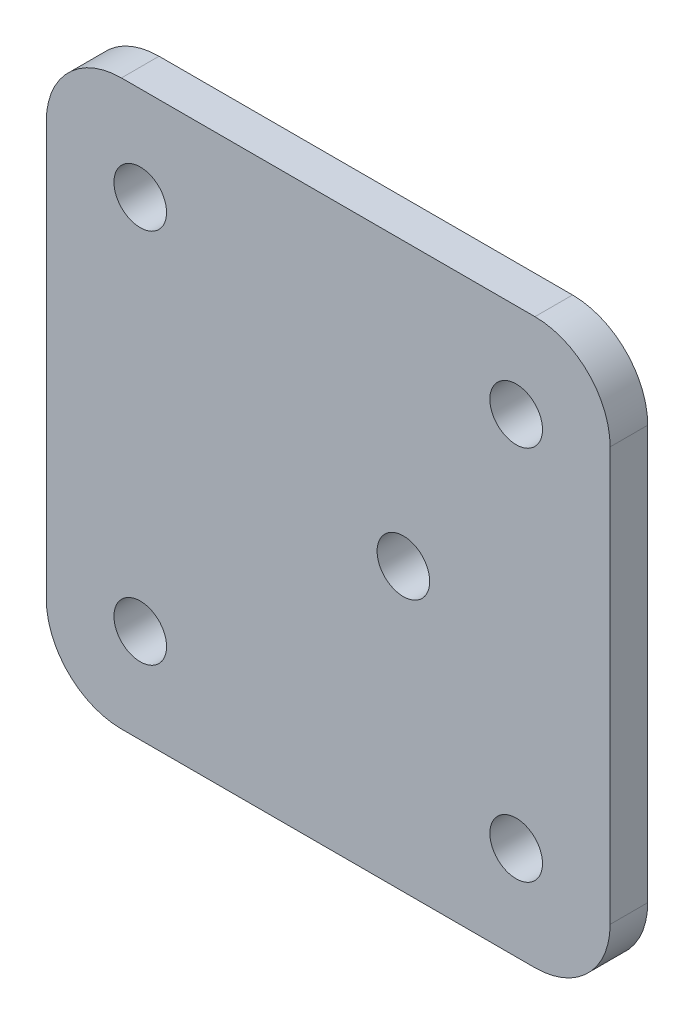
ISO-10303-21;
HEADER;
FILE_DESCRIPTION(('STEP AP214'),'2;1');
FILE_NAME('part.step','',(''),(''),'','','');
FILE_SCHEMA(('AUTOMOTIVE_DESIGN { 1 0 10303 214 1 1 1 1 }'));
ENDSEC;
DATA;
#1=APPLICATION_CONTEXT('core data for automotive mechanical design processes');
#2=APPLICATION_PROTOCOL_DEFINITION('international standard','automotive_design',2000,#1);
#3=PRODUCT_CONTEXT('',#1,'mechanical');
#4=PRODUCT('Part','Part','',(#3));
#5=PRODUCT_RELATED_PRODUCT_CATEGORY('part','',(#4));
#6=PRODUCT_DEFINITION_FORMATION('','',#4);
#7=PRODUCT_DEFINITION_CONTEXT('part definition',#1,'design');
#8=PRODUCT_DEFINITION('design','',#6,#7);
#9=PRODUCT_DEFINITION_SHAPE('','',#8);
#10=(LENGTH_UNIT() NAMED_UNIT(*) SI_UNIT(.MILLI.,.METRE.));
#11=(NAMED_UNIT(*) PLANE_ANGLE_UNIT() SI_UNIT($,.RADIAN.));
#12=(NAMED_UNIT(*) SI_UNIT($,.STERADIAN.) SOLID_ANGLE_UNIT());
#13=UNCERTAINTY_MEASURE_WITH_UNIT(LENGTH_MEASURE(1.E-05),#10,'distance_accuracy_value','');
#14=(GEOMETRIC_REPRESENTATION_CONTEXT(3) GLOBAL_UNCERTAINTY_ASSIGNED_CONTEXT((#13)) GLOBAL_UNIT_ASSIGNED_CONTEXT((#10,
#11,#12)) REPRESENTATION_CONTEXT('',''));
#15=CARTESIAN_POINT('',(0.,0.,0.));
#16=DIRECTION('',(0.,0.,1.));
#17=DIRECTION('',(1.,0.,0.));
#18=AXIS2_PLACEMENT_3D('',#15,#16,#17);
#19=CARTESIAN_POINT('',(-37.5,37.5,5.));
#20=DIRECTION('',(1.,0.,0.));
#21=DIRECTION('',(0.,1.,0.));
#22=AXIS2_PLACEMENT_3D('',#19,#20,#21);
#23=PLANE('',#22);
#24=DIRECTION('',(0.,-1.,0.));
#25=VECTOR('',#24,1.);
#26=CARTESIAN_POINT('',(-37.5,37.5,5.));
#27=LINE('',#26,#25);
#28=CARTESIAN_POINT('',(-37.5,27.5,5.));
#29=VERTEX_POINT('',#28);
#30=CARTESIAN_POINT('',(-37.5,-27.5,5.));
#31=VERTEX_POINT('',#30);
#32=EDGE_CURVE('E124',#29,#31,#27,.T.);
#33=ORIENTED_EDGE('',*,*,#32,.F.);
#34=DIRECTION('',(0.,0.,-1.));
#35=VECTOR('',#34,1.);
#36=CARTESIAN_POINT('',(-37.5,27.5,5.));
#37=LINE('',#36,#35);
#38=CARTESIAN_POINT('',(-37.5,27.5,0.));
#39=VERTEX_POINT('',#38);
#40=EDGE_CURVE('E109',#29,#39,#37,.T.);
#41=ORIENTED_EDGE('',*,*,#40,.T.);
#42=DIRECTION('',(0.,-1.,0.));
#43=VECTOR('',#42,1.);
#44=CARTESIAN_POINT('',(-37.5,37.5,0.));
#45=LINE('',#44,#43);
#46=CARTESIAN_POINT('',(-37.5,-27.5,0.));
#47=VERTEX_POINT('',#46);
#48=EDGE_CURVE('E121',#39,#47,#45,.T.);
#49=ORIENTED_EDGE('',*,*,#48,.T.);
#50=DIRECTION('',(0.,0.,-1.));
#51=VECTOR('',#50,1.);
#52=CARTESIAN_POINT('',(-37.5,-27.5,5.));
#53=LINE('',#52,#51);
#54=EDGE_CURVE('E126',#47,#31,#53,.F.);
#55=ORIENTED_EDGE('',*,*,#54,.T.);
#56=EDGE_LOOP('',(#33,#41,#49,#55));
#57=FACE_BOUND('',#56,.T.);
#58=ADVANCED_FACE('F39',(#57),#23,.F.);
#59=CARTESIAN_POINT('',(-37.5,-37.5,5.));
#60=DIRECTION('',(0.,1.,0.));
#61=DIRECTION('',(-1.,0.,0.));
#62=AXIS2_PLACEMENT_3D('',#59,#60,#61);
#63=PLANE('',#62);
#64=DIRECTION('',(1.,0.,0.));
#65=VECTOR('',#64,1.);
#66=CARTESIAN_POINT('',(-37.5,-37.5,5.));
#67=LINE('',#66,#65);
#68=CARTESIAN_POINT('',(-27.5,-37.5,5.));
#69=VERTEX_POINT('',#68);
#70=CARTESIAN_POINT('',(27.5,-37.5,5.));
#71=VERTEX_POINT('',#70);
#72=EDGE_CURVE('E170',#69,#71,#67,.T.);
#73=ORIENTED_EDGE('',*,*,#72,.F.);
#74=DIRECTION('',(0.,0.,-1.));
#75=VECTOR('',#74,1.);
#76=CARTESIAN_POINT('',(-27.5,-37.5,5.));
#77=LINE('',#76,#75);
#78=CARTESIAN_POINT('',(-27.5,-37.5,0.));
#79=VERTEX_POINT('',#78);
#80=EDGE_CURVE('E163',#69,#79,#77,.T.);
#81=ORIENTED_EDGE('',*,*,#80,.T.);
#82=DIRECTION('',(1.,0.,0.));
#83=VECTOR('',#82,1.);
#84=CARTESIAN_POINT('',(-37.5,-37.5,0.));
#85=LINE('',#84,#83);
#86=CARTESIAN_POINT('',(27.5,-37.5,0.));
#87=VERTEX_POINT('',#86);
#88=EDGE_CURVE('E130',#79,#87,#85,.T.);
#89=ORIENTED_EDGE('',*,*,#88,.T.);
#90=DIRECTION('',(0.,0.,-1.));
#91=VECTOR('',#90,1.);
#92=CARTESIAN_POINT('',(27.5,-37.5,5.));
#93=LINE('',#92,#91);
#94=EDGE_CURVE('E161',#87,#71,#93,.F.);
#95=ORIENTED_EDGE('',*,*,#94,.T.);
#96=EDGE_LOOP('',(#73,#81,#89,#95));
#97=FACE_BOUND('',#96,.T.);
#98=ADVANCED_FACE('F168',(#97),#63,.F.);
#99=CARTESIAN_POINT('',(37.5,37.5,5.));
#100=DIRECTION('',(-1.,0.,0.));
#101=DIRECTION('',(0.,0.,1.));
#102=AXIS2_PLACEMENT_3D('',#99,#100,#101);
#103=PLANE('',#102);
#104=DIRECTION('',(0.,1.,0.));
#105=VECTOR('',#104,1.);
#106=CARTESIAN_POINT('',(37.5,37.5,5.));
#107=LINE('',#106,#105);
#108=CARTESIAN_POINT('',(37.5,-27.5,5.));
#109=VERTEX_POINT('',#108);
#110=CARTESIAN_POINT('',(37.5,27.5,5.));
#111=VERTEX_POINT('',#110);
#112=EDGE_CURVE('E178',#109,#111,#107,.T.);
#113=ORIENTED_EDGE('',*,*,#112,.F.);
#114=DIRECTION('',(0.,0.,-1.));
#115=VECTOR('',#114,1.);
#116=CARTESIAN_POINT('',(37.5,-27.5,5.));
#117=LINE('',#116,#115);
#118=CARTESIAN_POINT('',(37.5,-27.5,0.));
#119=VERTEX_POINT('',#118);
#120=EDGE_CURVE('E11',#109,#119,#117,.T.);
#121=ORIENTED_EDGE('',*,*,#120,.T.);
#122=DIRECTION('',(0.,1.,0.));
#123=VECTOR('',#122,1.);
#124=CARTESIAN_POINT('',(37.5,37.5,0.));
#125=LINE('',#124,#123);
#126=CARTESIAN_POINT('',(37.5,27.5,0.));
#127=VERTEX_POINT('',#126);
#128=EDGE_CURVE('E134',#119,#127,#125,.T.);
#129=ORIENTED_EDGE('',*,*,#128,.T.);
#130=DIRECTION('',(0.,0.,-1.));
#131=VECTOR('',#130,1.);
#132=CARTESIAN_POINT('',(37.5,27.5,5.));
#133=LINE('',#132,#131);
#134=EDGE_CURVE('E47',#127,#111,#133,.F.);
#135=ORIENTED_EDGE('',*,*,#134,.T.);
#136=EDGE_LOOP('',(#113,#121,#129,#135));
#137=FACE_BOUND('',#136,.T.);
#138=ADVANCED_FACE('F177',(#137),#103,.F.);
#139=CARTESIAN_POINT('',(-37.5,37.5,5.));
#140=DIRECTION('',(0.,-1.,0.));
#141=DIRECTION('',(1.,0.,0.));
#142=AXIS2_PLACEMENT_3D('',#139,#140,#141);
#143=PLANE('',#142);
#144=DIRECTION('',(-1.,0.,0.));
#145=VECTOR('',#144,1.);
#146=CARTESIAN_POINT('',(-37.5,37.5,0.));
#147=LINE('',#146,#145);
#148=CARTESIAN_POINT('',(27.5,37.5,0.));
#149=VERTEX_POINT('',#148);
#150=CARTESIAN_POINT('',(-27.5,37.5,0.));
#151=VERTEX_POINT('',#150);
#152=EDGE_CURVE('E144',#149,#151,#147,.T.);
#153=ORIENTED_EDGE('',*,*,#152,.T.);
#154=DIRECTION('',(0.,0.,-1.));
#155=VECTOR('',#154,1.);
#156=CARTESIAN_POINT('',(-27.5,37.5,5.));
#157=LINE('',#156,#155);
#158=CARTESIAN_POINT('',(-27.5,37.5,5.));
#159=VERTEX_POINT('',#158);
#160=EDGE_CURVE('E110',#151,#159,#157,.F.);
#161=ORIENTED_EDGE('',*,*,#160,.T.);
#162=DIRECTION('',(-1.,0.,0.));
#163=VECTOR('',#162,1.);
#164=CARTESIAN_POINT('',(-37.5,37.5,5.));
#165=LINE('',#164,#163);
#166=CARTESIAN_POINT('',(27.5,37.5,5.));
#167=VERTEX_POINT('',#166);
#168=EDGE_CURVE('E140',#167,#159,#165,.T.);
#169=ORIENTED_EDGE('',*,*,#168,.F.);
#170=DIRECTION('',(0.,0.,-1.));
#171=VECTOR('',#170,1.);
#172=CARTESIAN_POINT('',(27.5,37.5,5.));
#173=LINE('',#172,#171);
#174=EDGE_CURVE('E115',#167,#149,#173,.T.);
#175=ORIENTED_EDGE('',*,*,#174,.T.);
#176=EDGE_LOOP('',(#153,#161,#169,#175));
#177=FACE_BOUND('',#176,.T.);
#178=ADVANCED_FACE('F216',(#177),#143,.F.);
#179=CARTESIAN_POINT('',(0.,0.,5.));
#180=DIRECTION('',(0.,0.,1.));
#181=DIRECTION('',(1.,0.,0.));
#182=AXIS2_PLACEMENT_3D('',#179,#180,#181);
#183=PLANE('',#182);
#184=CARTESIAN_POINT('',(10.,0.,5.));
#185=DIRECTION('',(0.,0.,1.));
#186=DIRECTION('',(1.,0.,0.));
#187=AXIS2_PLACEMENT_3D('',#184,#185,#186);
#188=CIRCLE('',#187,3.5);
#189=CARTESIAN_POINT('',(13.5,0.,5.));
#190=VERTEX_POINT('',#189);
#191=EDGE_CURVE('E207',#190,#190,#188,.T.);
#192=ORIENTED_EDGE('',*,*,#191,.F.);
#193=EDGE_LOOP('',(#192));
#194=FACE_BOUND('',#193,.T.);
#195=CARTESIAN_POINT('',(-25.,25.,5.));
#196=DIRECTION('',(0.,0.,1.));
#197=DIRECTION('',(1.,0.,0.));
#198=AXIS2_PLACEMENT_3D('',#195,#196,#197);
#199=CIRCLE('',#198,3.5);
#200=CARTESIAN_POINT('',(-21.5,25.,5.));
#201=VERTEX_POINT('',#200);
#202=EDGE_CURVE('E201',#201,#201,#199,.T.);
#203=ORIENTED_EDGE('',*,*,#202,.F.);
#204=EDGE_LOOP('',(#203));
#205=FACE_BOUND('',#204,.T.);
#206=CARTESIAN_POINT('',(-25.,-25.,5.));
#207=DIRECTION('',(0.,0.,1.));
#208=DIRECTION('',(1.,0.,0.));
#209=AXIS2_PLACEMENT_3D('',#206,#207,#208);
#210=CIRCLE('',#209,3.5);
#211=CARTESIAN_POINT('',(-21.5,-25.,5.));
#212=VERTEX_POINT('',#211);
#213=EDGE_CURVE('E195',#212,#212,#210,.T.);
#214=ORIENTED_EDGE('',*,*,#213,.F.);
#215=EDGE_LOOP('',(#214));
#216=FACE_BOUND('',#215,.T.);
#217=CARTESIAN_POINT('',(25.,-25.,5.));
#218=DIRECTION('',(0.,0.,1.));
#219=DIRECTION('',(1.,0.,0.));
#220=AXIS2_PLACEMENT_3D('',#217,#218,#219);
#221=CIRCLE('',#220,3.5);
#222=CARTESIAN_POINT('',(28.5,-25.,5.));
#223=VERTEX_POINT('',#222);
#224=EDGE_CURVE('E189',#223,#223,#221,.T.);
#225=ORIENTED_EDGE('',*,*,#224,.F.);
#226=EDGE_LOOP('',(#225));
#227=FACE_BOUND('',#226,.T.);
#228=CARTESIAN_POINT('',(25.,25.,5.));
#229=DIRECTION('',(0.,0.,1.));
#230=DIRECTION('',(1.,0.,0.));
#231=AXIS2_PLACEMENT_3D('',#228,#229,#230);
#232=CIRCLE('',#231,3.5);
#233=CARTESIAN_POINT('',(28.5,25.,5.));
#234=VERTEX_POINT('',#233);
#235=EDGE_CURVE('E137',#234,#234,#232,.T.);
#236=ORIENTED_EDGE('',*,*,#235,.F.);
#237=EDGE_LOOP('',(#236));
#238=FACE_BOUND('',#237,.T.);
#239=ORIENTED_EDGE('',*,*,#168,.T.);
#240=CARTESIAN_POINT('',(-27.5,27.5,5.));
#241=DIRECTION('',(0.,0.,1.));
#242=DIRECTION('',(1.,0.,0.));
#243=AXIS2_PLACEMENT_3D('',#240,#241,#242);
#244=CIRCLE('',#243,10.);
#245=EDGE_CURVE('E159',#159,#29,#244,.T.);
#246=ORIENTED_EDGE('',*,*,#245,.T.);
#247=ORIENTED_EDGE('',*,*,#32,.T.);
#248=CARTESIAN_POINT('',(-27.5,-27.5,5.));
#249=DIRECTION('',(0.,0.,1.));
#250=DIRECTION('',(1.,0.,0.));
#251=AXIS2_PLACEMENT_3D('',#248,#249,#250);
#252=CIRCLE('',#251,10.);
#253=EDGE_CURVE('E157',#31,#69,#252,.T.);
#254=ORIENTED_EDGE('',*,*,#253,.T.);
#255=ORIENTED_EDGE('',*,*,#72,.T.);
#256=CARTESIAN_POINT('',(27.5,-27.5,5.));
#257=DIRECTION('',(0.,0.,1.));
#258=DIRECTION('',(1.,0.,0.));
#259=AXIS2_PLACEMENT_3D('',#256,#257,#258);
#260=CIRCLE('',#259,10.);
#261=EDGE_CURVE('E60',#71,#109,#260,.T.);
#262=ORIENTED_EDGE('',*,*,#261,.T.);
#263=ORIENTED_EDGE('',*,*,#112,.T.);
#264=CARTESIAN_POINT('',(27.5,27.5,5.));
#265=DIRECTION('',(0.,0.,1.));
#266=DIRECTION('',(1.,0.,0.));
#267=AXIS2_PLACEMENT_3D('',#264,#265,#266);
#268=CIRCLE('',#267,10.);
#269=EDGE_CURVE('E154',#111,#167,#268,.T.);
#270=ORIENTED_EDGE('',*,*,#269,.T.);
#271=EDGE_LOOP('',(#239,#246,#247,#254,#255,#262,#263,#270));
#272=FACE_BOUND('',#271,.T.);
#273=ADVANCED_FACE('F213',(#194,#205,#216,#227,#238,#272),#183,.T.);
#274=CARTESIAN_POINT('',(0.,0.,0.));
#275=DIRECTION('',(0.,0.,1.));
#276=DIRECTION('',(1.,0.,0.));
#277=AXIS2_PLACEMENT_3D('',#274,#275,#276);
#278=PLANE('',#277);
#279=CARTESIAN_POINT('',(10.,0.,0.));
#280=DIRECTION('',(0.,0.,1.));
#281=DIRECTION('',(1.,0.,0.));
#282=AXIS2_PLACEMENT_3D('',#279,#280,#281);
#283=CIRCLE('',#282,3.5);
#284=CARTESIAN_POINT('',(13.5,0.,0.));
#285=VERTEX_POINT('',#284);
#286=EDGE_CURVE('E204',#285,#285,#283,.T.);
#287=ORIENTED_EDGE('',*,*,#286,.T.);
#288=EDGE_LOOP('',(#287));
#289=FACE_BOUND('',#288,.T.);
#290=CARTESIAN_POINT('',(-25.,25.,0.));
#291=DIRECTION('',(0.,0.,1.));
#292=DIRECTION('',(1.,0.,0.));
#293=AXIS2_PLACEMENT_3D('',#290,#291,#292);
#294=CIRCLE('',#293,3.5);
#295=CARTESIAN_POINT('',(-21.5,25.,0.));
#296=VERTEX_POINT('',#295);
#297=EDGE_CURVE('E198',#296,#296,#294,.T.);
#298=ORIENTED_EDGE('',*,*,#297,.T.);
#299=EDGE_LOOP('',(#298));
#300=FACE_BOUND('',#299,.T.);
#301=CARTESIAN_POINT('',(-25.,-25.,0.));
#302=DIRECTION('',(0.,0.,1.));
#303=DIRECTION('',(1.,0.,0.));
#304=AXIS2_PLACEMENT_3D('',#301,#302,#303);
#305=CIRCLE('',#304,3.5);
#306=CARTESIAN_POINT('',(-21.5,-25.,0.));
#307=VERTEX_POINT('',#306);
#308=EDGE_CURVE('E192',#307,#307,#305,.T.);
#309=ORIENTED_EDGE('',*,*,#308,.T.);
#310=EDGE_LOOP('',(#309));
#311=FACE_BOUND('',#310,.T.);
#312=CARTESIAN_POINT('',(25.,-25.,0.));
#313=DIRECTION('',(0.,0.,1.));
#314=DIRECTION('',(1.,0.,0.));
#315=AXIS2_PLACEMENT_3D('',#312,#313,#314);
#316=CIRCLE('',#315,3.5);
#317=CARTESIAN_POINT('',(28.5,-25.,0.));
#318=VERTEX_POINT('',#317);
#319=EDGE_CURVE('E186',#318,#318,#316,.T.);
#320=ORIENTED_EDGE('',*,*,#319,.T.);
#321=EDGE_LOOP('',(#320));
#322=FACE_BOUND('',#321,.T.);
#323=CARTESIAN_POINT('',(25.,25.,0.));
#324=DIRECTION('',(0.,0.,1.));
#325=DIRECTION('',(1.,0.,0.));
#326=AXIS2_PLACEMENT_3D('',#323,#324,#325);
#327=CIRCLE('',#326,3.5);
#328=CARTESIAN_POINT('',(28.5,25.,0.));
#329=VERTEX_POINT('',#328);
#330=EDGE_CURVE('E131',#329,#329,#327,.T.);
#331=ORIENTED_EDGE('',*,*,#330,.T.);
#332=EDGE_LOOP('',(#331));
#333=FACE_BOUND('',#332,.T.);
#334=ORIENTED_EDGE('',*,*,#48,.F.);
#335=CARTESIAN_POINT('',(-27.5,27.5,0.));
#336=DIRECTION('',(0.,0.,1.));
#337=DIRECTION('',(1.,0.,0.));
#338=AXIS2_PLACEMENT_3D('',#335,#336,#337);
#339=CIRCLE('',#338,10.);
#340=EDGE_CURVE('E105',#39,#151,#339,.F.);
#341=ORIENTED_EDGE('',*,*,#340,.T.);
#342=ORIENTED_EDGE('',*,*,#152,.F.);
#343=CARTESIAN_POINT('',(27.5,27.5,0.));
#344=DIRECTION('',(0.,0.,1.));
#345=DIRECTION('',(1.,0.,0.));
#346=AXIS2_PLACEMENT_3D('',#343,#344,#345);
#347=CIRCLE('',#346,10.);
#348=EDGE_CURVE('E125',#149,#127,#347,.F.);
#349=ORIENTED_EDGE('',*,*,#348,.T.);
#350=ORIENTED_EDGE('',*,*,#128,.F.);
#351=CARTESIAN_POINT('',(27.5,-27.5,0.));
#352=DIRECTION('',(0.,0.,1.));
#353=DIRECTION('',(1.,0.,0.));
#354=AXIS2_PLACEMENT_3D('',#351,#352,#353);
#355=CIRCLE('',#354,10.);
#356=EDGE_CURVE('E148',#119,#87,#355,.F.);
#357=ORIENTED_EDGE('',*,*,#356,.T.);
#358=ORIENTED_EDGE('',*,*,#88,.F.);
#359=CARTESIAN_POINT('',(-27.5,-27.5,0.));
#360=DIRECTION('',(0.,0.,1.));
#361=DIRECTION('',(1.,0.,0.));
#362=AXIS2_PLACEMENT_3D('',#359,#360,#361);
#363=CIRCLE('',#362,10.);
#364=EDGE_CURVE('E116',#79,#47,#363,.F.);
#365=ORIENTED_EDGE('',*,*,#364,.T.);
#366=EDGE_LOOP('',(#334,#341,#342,#349,#350,#357,#358,#365));
#367=FACE_BOUND('',#366,.T.);
#368=ADVANCED_FACE('F128',(#289,#300,#311,#322,#333,#367),#278,.F.);
#369=CARTESIAN_POINT('',(25.,25.,5.));
#370=DIRECTION('',(0.,0.,1.));
#371=DIRECTION('',(1.,0.,0.));
#372=AXIS2_PLACEMENT_3D('',#369,#370,#371);
#373=CYLINDRICAL_SURFACE('',#372,3.5);
#374=ORIENTED_EDGE('',*,*,#330,.F.);
#375=EDGE_LOOP('',(#374));
#376=FACE_BOUND('',#375,.T.);
#377=ORIENTED_EDGE('',*,*,#235,.T.);
#378=EDGE_LOOP('',(#377));
#379=FACE_BOUND('',#378,.T.);
#380=ADVANCED_FACE('F280',(#376,#379),#373,.F.);
#381=CARTESIAN_POINT('',(25.,-25.,5.));
#382=DIRECTION('',(0.,0.,1.));
#383=DIRECTION('',(1.,0.,0.));
#384=AXIS2_PLACEMENT_3D('',#381,#382,#383);
#385=CYLINDRICAL_SURFACE('',#384,3.5);
#386=ORIENTED_EDGE('',*,*,#319,.F.);
#387=EDGE_LOOP('',(#386));
#388=FACE_BOUND('',#387,.T.);
#389=ORIENTED_EDGE('',*,*,#224,.T.);
#390=EDGE_LOOP('',(#389));
#391=FACE_BOUND('',#390,.T.);
#392=ADVANCED_FACE('F295',(#388,#391),#385,.F.);
#393=CARTESIAN_POINT('',(-25.,-25.,5.));
#394=DIRECTION('',(0.,0.,1.));
#395=DIRECTION('',(1.,0.,0.));
#396=AXIS2_PLACEMENT_3D('',#393,#394,#395);
#397=CYLINDRICAL_SURFACE('',#396,3.5);
#398=ORIENTED_EDGE('',*,*,#308,.F.);
#399=EDGE_LOOP('',(#398));
#400=FACE_BOUND('',#399,.T.);
#401=ORIENTED_EDGE('',*,*,#213,.T.);
#402=EDGE_LOOP('',(#401));
#403=FACE_BOUND('',#402,.T.);
#404=ADVANCED_FACE('F302',(#400,#403),#397,.F.);
#405=CARTESIAN_POINT('',(-25.,25.,5.));
#406=DIRECTION('',(0.,0.,1.));
#407=DIRECTION('',(1.,0.,0.));
#408=AXIS2_PLACEMENT_3D('',#405,#406,#407);
#409=CYLINDRICAL_SURFACE('',#408,3.5);
#410=ORIENTED_EDGE('',*,*,#297,.F.);
#411=EDGE_LOOP('',(#410));
#412=FACE_BOUND('',#411,.T.);
#413=ORIENTED_EDGE('',*,*,#202,.T.);
#414=EDGE_LOOP('',(#413));
#415=FACE_BOUND('',#414,.T.);
#416=ADVANCED_FACE('F247',(#412,#415),#409,.F.);
#417=CARTESIAN_POINT('',(-27.5,27.5,5.));
#418=DIRECTION('',(0.,0.,-1.));
#419=DIRECTION('',(-1.,0.,0.));
#420=AXIS2_PLACEMENT_3D('',#417,#418,#419);
#421=CYLINDRICAL_SURFACE('',#420,10.);
#422=ORIENTED_EDGE('',*,*,#245,.F.);
#423=ORIENTED_EDGE('',*,*,#160,.F.);
#424=ORIENTED_EDGE('',*,*,#340,.F.);
#425=ORIENTED_EDGE('',*,*,#40,.F.);
#426=EDGE_LOOP('',(#422,#423,#424,#425));
#427=FACE_BOUND('',#426,.T.);
#428=ADVANCED_FACE('F108',(#427),#421,.T.);
#429=CARTESIAN_POINT('',(-27.5,-27.5,5.));
#430=DIRECTION('',(0.,0.,-1.));
#431=DIRECTION('',(-1.,0.,0.));
#432=AXIS2_PLACEMENT_3D('',#429,#430,#431);
#433=CYLINDRICAL_SURFACE('',#432,10.);
#434=ORIENTED_EDGE('',*,*,#253,.F.);
#435=ORIENTED_EDGE('',*,*,#54,.F.);
#436=ORIENTED_EDGE('',*,*,#364,.F.);
#437=ORIENTED_EDGE('',*,*,#80,.F.);
#438=EDGE_LOOP('',(#434,#435,#436,#437));
#439=FACE_BOUND('',#438,.T.);
#440=ADVANCED_FACE('F236',(#439),#433,.T.);
#441=CARTESIAN_POINT('',(27.5,-27.5,5.));
#442=DIRECTION('',(0.,0.,-1.));
#443=DIRECTION('',(-1.,0.,0.));
#444=AXIS2_PLACEMENT_3D('',#441,#442,#443);
#445=CYLINDRICAL_SURFACE('',#444,10.);
#446=ORIENTED_EDGE('',*,*,#261,.F.);
#447=ORIENTED_EDGE('',*,*,#94,.F.);
#448=ORIENTED_EDGE('',*,*,#356,.F.);
#449=ORIENTED_EDGE('',*,*,#120,.F.);
#450=EDGE_LOOP('',(#446,#447,#448,#449));
#451=FACE_BOUND('',#450,.T.);
#452=ADVANCED_FACE('F176',(#451),#445,.T.);
#453=CARTESIAN_POINT('',(27.5,27.5,5.));
#454=DIRECTION('',(0.,0.,-1.));
#455=DIRECTION('',(-1.,0.,0.));
#456=AXIS2_PLACEMENT_3D('',#453,#454,#455);
#457=CYLINDRICAL_SURFACE('',#456,10.);
#458=ORIENTED_EDGE('',*,*,#269,.F.);
#459=ORIENTED_EDGE('',*,*,#134,.F.);
#460=ORIENTED_EDGE('',*,*,#348,.F.);
#461=ORIENTED_EDGE('',*,*,#174,.F.);
#462=EDGE_LOOP('',(#458,#459,#460,#461));
#463=FACE_BOUND('',#462,.T.);
#464=ADVANCED_FACE('F41',(#463),#457,.T.);
#465=CARTESIAN_POINT('',(10.,0.,5.));
#466=DIRECTION('',(0.,0.,1.));
#467=DIRECTION('',(1.,0.,0.));
#468=AXIS2_PLACEMENT_3D('',#465,#466,#467);
#469=CYLINDRICAL_SURFACE('',#468,3.5);
#470=ORIENTED_EDGE('',*,*,#286,.F.);
#471=EDGE_LOOP('',(#470));
#472=FACE_BOUND('',#471,.T.);
#473=ORIENTED_EDGE('',*,*,#191,.T.);
#474=EDGE_LOOP('',(#473));
#475=FACE_BOUND('',#474,.T.);
#476=ADVANCED_FACE('F211',(#472,#475),#469,.F.);
#477=CLOSED_SHELL('',(#58,#98,#138,#178,#273,#368,#380,#392,#404,#416,#428,#440,#452,#464,#476));
#478=MANIFOLD_SOLID_BREP('B2',#477);
#479=ADVANCED_BREP_SHAPE_REPRESENTATION('',(#18,#478),#14);
#480=SHAPE_DEFINITION_REPRESENTATION(#9,#479);
ENDSEC;
END-ISO-10303-21;
